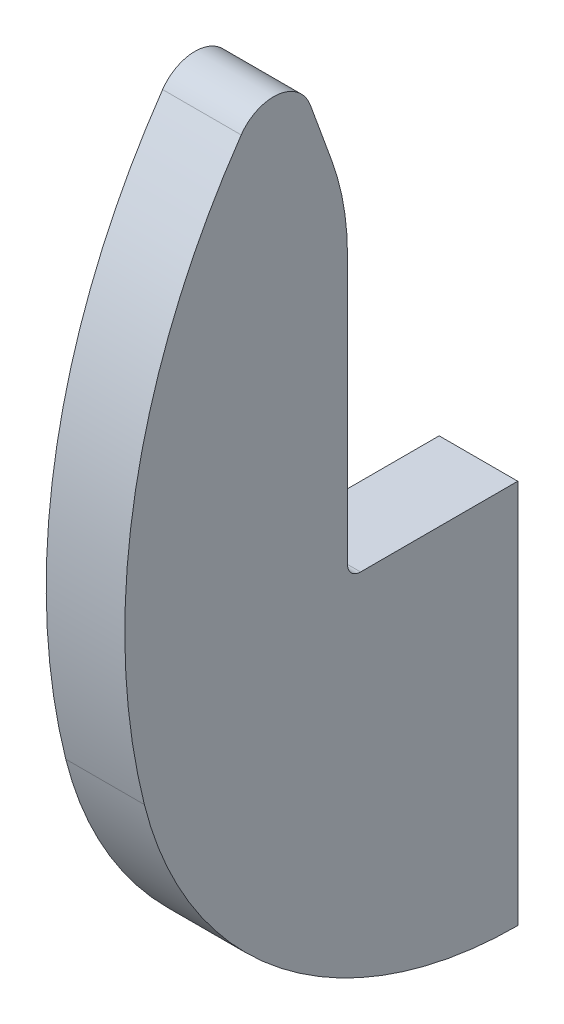
ISO-10303-21;
HEADER;
FILE_DESCRIPTION(('STEP AP214'),'2;1');
FILE_NAME('part.step','',(''),(''),'','','');
FILE_SCHEMA(('AUTOMOTIVE_DESIGN { 1 0 10303 214 1 1 1 1 }'));
ENDSEC;
DATA;
#1=APPLICATION_CONTEXT('core data for automotive mechanical design processes');
#2=APPLICATION_PROTOCOL_DEFINITION('international standard','automotive_design',2000,#1);
#3=PRODUCT_CONTEXT('',#1,'mechanical');
#4=PRODUCT('Part','Part','',(#3));
#5=PRODUCT_RELATED_PRODUCT_CATEGORY('part','',(#4));
#6=PRODUCT_DEFINITION_FORMATION('','',#4);
#7=PRODUCT_DEFINITION_CONTEXT('part definition',#1,'design');
#8=PRODUCT_DEFINITION('design','',#6,#7);
#9=PRODUCT_DEFINITION_SHAPE('','',#8);
#10=(LENGTH_UNIT() NAMED_UNIT(*) SI_UNIT(.MILLI.,.METRE.));
#11=(NAMED_UNIT(*) PLANE_ANGLE_UNIT() SI_UNIT($,.RADIAN.));
#12=(NAMED_UNIT(*) SI_UNIT($,.STERADIAN.) SOLID_ANGLE_UNIT());
#13=UNCERTAINTY_MEASURE_WITH_UNIT(LENGTH_MEASURE(1.E-05),#10,'distance_accuracy_value','');
#14=(GEOMETRIC_REPRESENTATION_CONTEXT(3) GLOBAL_UNCERTAINTY_ASSIGNED_CONTEXT((#13)) GLOBAL_UNIT_ASSIGNED_CONTEXT((#10,
#11,#12)) REPRESENTATION_CONTEXT('',''));
#15=CARTESIAN_POINT('',(0.,0.,0.));
#16=DIRECTION('',(0.,0.,1.));
#17=DIRECTION('',(1.,0.,0.));
#18=AXIS2_PLACEMENT_3D('',#15,#16,#17);
#19=CARTESIAN_POINT('',(289.5,203.,13.));
#20=DIRECTION('',(0.,-1.,0.));
#21=DIRECTION('',(0.,0.,-1.));
#22=AXIS2_PLACEMENT_3D('',#19,#20,#21);
#23=PLANE('',#22);
#24=DIRECTION('',(0.,0.,1.));
#25=VECTOR('',#24,1.);
#26=CARTESIAN_POINT('',(283.5,203.,13.));
#27=LINE('',#26,#25);
#28=CARTESIAN_POINT('',(283.5,203.,0.));
#29=VERTEX_POINT('',#28);
#30=CARTESIAN_POINT('',(283.5,203.,12.));
#31=VERTEX_POINT('',#30);
#32=EDGE_CURVE('E148',#29,#31,#27,.T.);
#33=ORIENTED_EDGE('',*,*,#32,.T.);
#34=DIRECTION('',(-1.,0.,0.));
#35=VECTOR('',#34,1.);
#36=CARTESIAN_POINT('',(289.5,203.,12.));
#37=LINE('',#36,#35);
#38=CARTESIAN_POINT('',(289.5,203.,12.));
#39=VERTEX_POINT('',#38);
#40=EDGE_CURVE('E56',#31,#39,#37,.F.);
#41=ORIENTED_EDGE('',*,*,#40,.T.);
#42=DIRECTION('',(0.,0.,1.));
#43=VECTOR('',#42,1.);
#44=CARTESIAN_POINT('',(289.5,203.,13.));
#45=LINE('',#44,#43);
#46=CARTESIAN_POINT('',(289.5,203.,0.));
#47=VERTEX_POINT('',#46);
#48=EDGE_CURVE('E165',#47,#39,#45,.T.);
#49=ORIENTED_EDGE('',*,*,#48,.F.);
#50=DIRECTION('',(-1.,0.,0.));
#51=VECTOR('',#50,1.);
#52=CARTESIAN_POINT('',(289.5,203.,0.));
#53=LINE('',#52,#51);
#54=EDGE_CURVE('E144',#47,#29,#53,.T.);
#55=ORIENTED_EDGE('',*,*,#54,.T.);
#56=EDGE_LOOP('',(#33,#41,#49,#55));
#57=FACE_BOUND('',#56,.T.);
#58=ADVANCED_FACE('F40',(#57),#23,.F.);
#59=CARTESIAN_POINT('',(289.5,203.,13.));
#60=DIRECTION('',(0.,0.,1.));
#61=DIRECTION('',(1.,0.,0.));
#62=AXIS2_PLACEMENT_3D('',#59,#60,#61);
#63=PLANE('',#62);
#64=DIRECTION('',(0.,1.,0.));
#65=VECTOR('',#64,1.);
#66=CARTESIAN_POINT('',(289.5,203.,13.));
#67=LINE('',#66,#65);
#68=CARTESIAN_POINT('',(289.5,204.,13.));
#69=VERTEX_POINT('',#68);
#70=CARTESIAN_POINT('',(289.5,224.473460385831,13.));
#71=VERTEX_POINT('',#70);
#72=EDGE_CURVE('E209',#69,#71,#67,.T.);
#73=ORIENTED_EDGE('',*,*,#72,.F.);
#74=DIRECTION('',(-1.,0.,0.));
#75=VECTOR('',#74,1.);
#76=CARTESIAN_POINT('',(283.5,204.,13.));
#77=LINE('',#76,#75);
#78=CARTESIAN_POINT('',(283.5,204.,13.));
#79=VERTEX_POINT('',#78);
#80=EDGE_CURVE('E198',#69,#79,#77,.T.);
#81=ORIENTED_EDGE('',*,*,#80,.T.);
#82=DIRECTION('',(0.,1.,0.));
#83=VECTOR('',#82,1.);
#84=CARTESIAN_POINT('',(283.5,203.,13.));
#85=LINE('',#84,#83);
#86=CARTESIAN_POINT('',(283.5,224.473460385831,13.));
#87=VERTEX_POINT('',#86);
#88=EDGE_CURVE('E151',#79,#87,#85,.T.);
#89=ORIENTED_EDGE('',*,*,#88,.T.);
#90=DIRECTION('',(-1.,0.,0.));
#91=VECTOR('',#90,1.);
#92=CARTESIAN_POINT('',(289.5,224.473460385831,13.));
#93=LINE('',#92,#91);
#94=EDGE_CURVE('E191',#87,#71,#93,.F.);
#95=ORIENTED_EDGE('',*,*,#94,.T.);
#96=EDGE_LOOP('',(#73,#81,#89,#95));
#97=FACE_BOUND('',#96,.T.);
#98=ADVANCED_FACE('F222',(#97),#63,.F.);
#99=CARTESIAN_POINT('',(289.5,228.,13.));
#100=DIRECTION('',(0.,-0.342020143325669,0.939692620785908));
#101=DIRECTION('',(0.,-0.939692620785908,-0.342020143325669));
#102=AXIS2_PLACEMENT_3D('',#99,#100,#101);
#103=PLANE('',#102);
#104=DIRECTION('',(0.,0.939692620785908,0.342020143325669));
#105=VECTOR('',#104,1.);
#106=CARTESIAN_POINT('',(289.5,228.,13.));
#107=LINE('',#106,#105);
#108=CARTESIAN_POINT('',(289.5,231.313863252344,14.2061475842818));
#109=VERTEX_POINT('',#108);
#110=CARTESIAN_POINT('',(289.5,235.771976199503,15.8287679980445));
#111=VERTEX_POINT('',#110);
#112=EDGE_CURVE('E123',#109,#111,#107,.T.);
#113=ORIENTED_EDGE('',*,*,#112,.F.);
#114=DIRECTION('',(-1.,0.,0.));
#115=VECTOR('',#114,1.);
#116=CARTESIAN_POINT('',(289.5,231.313863252344,14.2061475842818));
#117=LINE('',#116,#115);
#118=CARTESIAN_POINT('',(283.5,231.313863252344,14.2061475842818));
#119=VERTEX_POINT('',#118);
#120=EDGE_CURVE('E183',#109,#119,#117,.T.);
#121=ORIENTED_EDGE('',*,*,#120,.T.);
#122=DIRECTION('',(0.,0.939692620785908,0.342020143325669));
#123=VECTOR('',#122,1.);
#124=CARTESIAN_POINT('',(283.5,228.,13.));
#125=LINE('',#124,#123);
#126=CARTESIAN_POINT('',(283.5,235.771976199503,15.8287679980445));
#127=VERTEX_POINT('',#126);
#128=EDGE_CURVE('E154',#119,#127,#125,.T.);
#129=ORIENTED_EDGE('',*,*,#128,.T.);
#130=DIRECTION('',(-1.,0.,0.));
#131=VECTOR('',#130,1.);
#132=CARTESIAN_POINT('',(289.5,235.771976199503,15.8287679980445));
#133=LINE('',#132,#131);
#134=EDGE_CURVE('E177',#127,#111,#133,.F.);
#135=ORIENTED_EDGE('',*,*,#134,.T.);
#136=EDGE_LOOP('',(#113,#121,#129,#135));
#137=FACE_BOUND('',#136,.T.);
#138=ADVANCED_FACE('F231',(#137),#103,.F.);
#139=CARTESIAN_POINT('',(289.5,208.,-20.));
#140=DIRECTION('',(-1.,0.,0.));
#141=DIRECTION('',(0.,0.,1.));
#142=AXIS2_PLACEMENT_3D('',#139,#140,#141);
#143=CYLINDRICAL_SURFACE('',#142,50.);
#144=CARTESIAN_POINT('',(289.5,208.,-20.));
#145=DIRECTION('',(1.,0.,0.));
#146=DIRECTION('',(0.,0.,-1.));
#147=AXIS2_PLACEMENT_3D('',#144,#145,#146);
#148=CIRCLE('',#147,50.);
#149=CARTESIAN_POINT('',(289.5,236.453101882475,21.1147296387258));
#150=VERTEX_POINT('',#149);
#151=CARTESIAN_POINT('',(289.5,195.873218748183,28.5071250072666));
#152=VERTEX_POINT('',#151);
#153=EDGE_CURVE('E111',#150,#152,#148,.T.);
#154=ORIENTED_EDGE('',*,*,#153,.F.);
#155=DIRECTION('',(-1.,0.,0.));
#156=VECTOR('',#155,1.);
#157=CARTESIAN_POINT('',(289.5,236.453101882475,21.1147296387258));
#158=LINE('',#157,#156);
#159=CARTESIAN_POINT('',(283.5,236.453101882475,21.1147296387258));
#160=VERTEX_POINT('',#159);
#161=EDGE_CURVE('E133',#150,#160,#158,.T.);
#162=ORIENTED_EDGE('',*,*,#161,.T.);
#163=CARTESIAN_POINT('',(283.5,208.,-20.));
#164=DIRECTION('',(1.,0.,0.));
#165=DIRECTION('',(0.,0.,-1.));
#166=AXIS2_PLACEMENT_3D('',#163,#164,#165);
#167=CIRCLE('',#166,50.);
#168=CARTESIAN_POINT('',(283.5,195.873218748183,28.5071250072666));
#169=VERTEX_POINT('',#168);
#170=EDGE_CURVE('E129',#160,#169,#167,.T.);
#171=ORIENTED_EDGE('',*,*,#170,.T.);
#172=DIRECTION('',(-1.,0.,0.));
#173=VECTOR('',#172,1.);
#174=CARTESIAN_POINT('',(289.5,195.873218748183,28.5071250072666));
#175=LINE('',#174,#173);
#176=EDGE_CURVE('E126',#152,#169,#175,.T.);
#177=ORIENTED_EDGE('',*,*,#176,.F.);
#178=EDGE_LOOP('',(#154,#162,#171,#177));
#179=FACE_BOUND('',#178,.T.);
#180=ADVANCED_FACE('F127',(#179),#143,.T.);
#181=CARTESIAN_POINT('',(289.5,203.,0.));
#182=DIRECTION('',(-1.,0.,0.));
#183=DIRECTION('',(0.,0.,1.));
#184=AXIS2_PLACEMENT_3D('',#181,#182,#183);
#185=CYLINDRICAL_SURFACE('',#184,29.3844718719117);
#186=CARTESIAN_POINT('',(283.5,203.,0.));
#187=DIRECTION('',(1.,0.,0.));
#188=DIRECTION('',(0.,0.,-1.));
#189=AXIS2_PLACEMENT_3D('',#186,#187,#188);
#190=CIRCLE('',#189,29.3844718719117);
#191=CARTESIAN_POINT('',(283.5,173.615528128088,0.));
#192=VERTEX_POINT('',#191);
#193=EDGE_CURVE('E159',#169,#192,#190,.T.);
#194=ORIENTED_EDGE('',*,*,#193,.T.);
#195=DIRECTION('',(-1.,0.,0.));
#196=VECTOR('',#195,1.);
#197=CARTESIAN_POINT('',(289.5,173.615528128088,0.));
#198=LINE('',#197,#196);
#199=CARTESIAN_POINT('',(289.5,173.615528128088,0.));
#200=VERTEX_POINT('',#199);
#201=EDGE_CURVE('E134',#200,#192,#198,.T.);
#202=ORIENTED_EDGE('',*,*,#201,.F.);
#203=CARTESIAN_POINT('',(289.5,203.,0.));
#204=DIRECTION('',(1.,0.,0.));
#205=DIRECTION('',(0.,0.,-1.));
#206=AXIS2_PLACEMENT_3D('',#203,#204,#205);
#207=CIRCLE('',#206,29.3844718719117);
#208=EDGE_CURVE('E115',#152,#200,#207,.T.);
#209=ORIENTED_EDGE('',*,*,#208,.F.);
#210=ORIENTED_EDGE('',*,*,#176,.T.);
#211=EDGE_LOOP('',(#194,#202,#209,#210));
#212=FACE_BOUND('',#211,.T.);
#213=ADVANCED_FACE('F136',(#212),#185,.T.);
#214=CARTESIAN_POINT('',(289.5,173.615528128088,0.));
#215=DIRECTION('',(0.,0.,1.));
#216=DIRECTION('',(1.,0.,0.));
#217=AXIS2_PLACEMENT_3D('',#214,#215,#216);
#218=PLANE('',#217);
#219=DIRECTION('',(0.,1.,0.));
#220=VECTOR('',#219,1.);
#221=CARTESIAN_POINT('',(283.5,173.615528128088,0.));
#222=LINE('',#221,#220);
#223=EDGE_CURVE('E162',#192,#29,#222,.T.);
#224=ORIENTED_EDGE('',*,*,#223,.T.);
#225=ORIENTED_EDGE('',*,*,#54,.F.);
#226=DIRECTION('',(0.,1.,0.));
#227=VECTOR('',#226,1.);
#228=CARTESIAN_POINT('',(289.5,173.615528128088,0.));
#229=LINE('',#228,#227);
#230=EDGE_CURVE('E140',#200,#47,#229,.T.);
#231=ORIENTED_EDGE('',*,*,#230,.F.);
#232=ORIENTED_EDGE('',*,*,#201,.T.);
#233=EDGE_LOOP('',(#224,#225,#231,#232));
#234=FACE_BOUND('',#233,.T.);
#235=ADVANCED_FACE('F237',(#234),#218,.F.);
#236=CARTESIAN_POINT('',(289.5,203.,0.));
#237=DIRECTION('',(1.,0.,0.));
#238=DIRECTION('',(0.,0.,-1.));
#239=AXIS2_PLACEMENT_3D('',#236,#237,#238);
#240=PLANE('',#239);
#241=ORIENTED_EDGE('',*,*,#48,.T.);
#242=CARTESIAN_POINT('',(289.5,204.,12.));
#243=DIRECTION('',(1.,0.,0.));
#244=DIRECTION('',(0.,0.,-1.));
#245=AXIS2_PLACEMENT_3D('',#242,#243,#244);
#246=CIRCLE('',#245,1.);
#247=EDGE_CURVE('E11',#39,#69,#246,.F.);
#248=ORIENTED_EDGE('',*,*,#247,.T.);
#249=ORIENTED_EDGE('',*,*,#72,.T.);
#250=CARTESIAN_POINT('',(289.5,224.473460385831,33.));
#251=DIRECTION('',(1.,0.,0.));
#252=DIRECTION('',(0.,0.,-1.));
#253=AXIS2_PLACEMENT_3D('',#250,#251,#252);
#254=CIRCLE('',#253,20.);
#255=EDGE_CURVE('E195',#71,#109,#254,.T.);
#256=ORIENTED_EDGE('',*,*,#255,.T.);
#257=ORIENTED_EDGE('',*,*,#112,.T.);
#258=CARTESIAN_POINT('',(289.5,234.745915769526,18.6478458604022));
#259=DIRECTION('',(1.,0.,0.));
#260=DIRECTION('',(0.,0.,-1.));
#261=AXIS2_PLACEMENT_3D('',#258,#259,#260);
#262=CIRCLE('',#261,3.);
#263=EDGE_CURVE('E118',#111,#150,#262,.T.);
#264=ORIENTED_EDGE('',*,*,#263,.T.);
#265=ORIENTED_EDGE('',*,*,#153,.T.);
#266=ORIENTED_EDGE('',*,*,#208,.T.);
#267=ORIENTED_EDGE('',*,*,#230,.T.);
#268=EDGE_LOOP('',(#241,#248,#249,#256,#257,#264,#265,#266,#267));
#269=FACE_BOUND('',#268,.T.);
#270=ADVANCED_FACE('F113',(#269),#240,.T.);
#271=CARTESIAN_POINT('',(283.5,203.,0.));
#272=DIRECTION('',(1.,0.,0.));
#273=DIRECTION('',(0.,0.,-1.));
#274=AXIS2_PLACEMENT_3D('',#271,#272,#273);
#275=PLANE('',#274);
#276=ORIENTED_EDGE('',*,*,#128,.F.);
#277=CARTESIAN_POINT('',(283.5,224.473460385831,33.));
#278=DIRECTION('',(1.,0.,0.));
#279=DIRECTION('',(0.,0.,-1.));
#280=AXIS2_PLACEMENT_3D('',#277,#278,#279);
#281=CIRCLE('',#280,20.);
#282=EDGE_CURVE('E187',#119,#87,#281,.F.);
#283=ORIENTED_EDGE('',*,*,#282,.T.);
#284=ORIENTED_EDGE('',*,*,#88,.F.);
#285=CARTESIAN_POINT('',(283.5,204.,12.));
#286=DIRECTION('',(1.,0.,0.));
#287=DIRECTION('',(0.,0.,-1.));
#288=AXIS2_PLACEMENT_3D('',#285,#286,#287);
#289=CIRCLE('',#288,1.);
#290=EDGE_CURVE('E49',#79,#31,#289,.T.);
#291=ORIENTED_EDGE('',*,*,#290,.T.);
#292=ORIENTED_EDGE('',*,*,#32,.F.);
#293=ORIENTED_EDGE('',*,*,#223,.F.);
#294=ORIENTED_EDGE('',*,*,#193,.F.);
#295=ORIENTED_EDGE('',*,*,#170,.F.);
#296=CARTESIAN_POINT('',(283.5,234.745915769526,18.6478458604022));
#297=DIRECTION('',(1.,0.,0.));
#298=DIRECTION('',(0.,0.,-1.));
#299=AXIS2_PLACEMENT_3D('',#296,#297,#298);
#300=CIRCLE('',#299,3.);
#301=EDGE_CURVE('E173',#160,#127,#300,.F.);
#302=ORIENTED_EDGE('',*,*,#301,.T.);
#303=EDGE_LOOP('',(#276,#283,#284,#291,#292,#293,#294,#295,#302));
#304=FACE_BOUND('',#303,.T.);
#305=ADVANCED_FACE('F42',(#304),#275,.F.);
#306=CARTESIAN_POINT('',(289.5,234.745915769526,18.6478458604022));
#307=DIRECTION('',(-1.,0.,0.));
#308=DIRECTION('',(0.,0.,1.));
#309=AXIS2_PLACEMENT_3D('',#306,#307,#308);
#310=CYLINDRICAL_SURFACE('',#309,3.);
#311=ORIENTED_EDGE('',*,*,#263,.F.);
#312=ORIENTED_EDGE('',*,*,#134,.F.);
#313=ORIENTED_EDGE('',*,*,#301,.F.);
#314=ORIENTED_EDGE('',*,*,#161,.F.);
#315=EDGE_LOOP('',(#311,#312,#313,#314));
#316=FACE_BOUND('',#315,.T.);
#317=ADVANCED_FACE('F234',(#316),#310,.T.);
#318=CARTESIAN_POINT('',(289.5,224.473460385831,33.));
#319=DIRECTION('',(-1.,0.,0.));
#320=DIRECTION('',(0.,0.,1.));
#321=AXIS2_PLACEMENT_3D('',#318,#319,#320);
#322=CYLINDRICAL_SURFACE('',#321,20.);
#323=ORIENTED_EDGE('',*,*,#255,.F.);
#324=ORIENTED_EDGE('',*,*,#94,.F.);
#325=ORIENTED_EDGE('',*,*,#282,.F.);
#326=ORIENTED_EDGE('',*,*,#120,.F.);
#327=EDGE_LOOP('',(#323,#324,#325,#326));
#328=FACE_BOUND('',#327,.T.);
#329=ADVANCED_FACE('F228',(#328),#322,.T.);
#330=CARTESIAN_POINT('',(289.5,204.,12.));
#331=DIRECTION('',(1.,0.,0.));
#332=DIRECTION('',(0.,0.,-1.));
#333=AXIS2_PLACEMENT_3D('',#330,#331,#332);
#334=CYLINDRICAL_SURFACE('',#333,1.);
#335=ORIENTED_EDGE('',*,*,#247,.F.);
#336=ORIENTED_EDGE('',*,*,#40,.F.);
#337=ORIENTED_EDGE('',*,*,#290,.F.);
#338=ORIENTED_EDGE('',*,*,#80,.F.);
#339=EDGE_LOOP('',(#335,#336,#337,#338));
#340=FACE_BOUND('',#339,.T.);
#341=ADVANCED_FACE('F220',(#340),#334,.F.);
#342=CLOSED_SHELL('',(#58,#98,#138,#180,#213,#235,#270,#305,#317,#329,#341));
#343=MANIFOLD_SOLID_BREP('B2',#342);
#344=ADVANCED_BREP_SHAPE_REPRESENTATION('',(#18,#343),#14);
#345=SHAPE_DEFINITION_REPRESENTATION(#9,#344);
ENDSEC;
END-ISO-10303-21;
